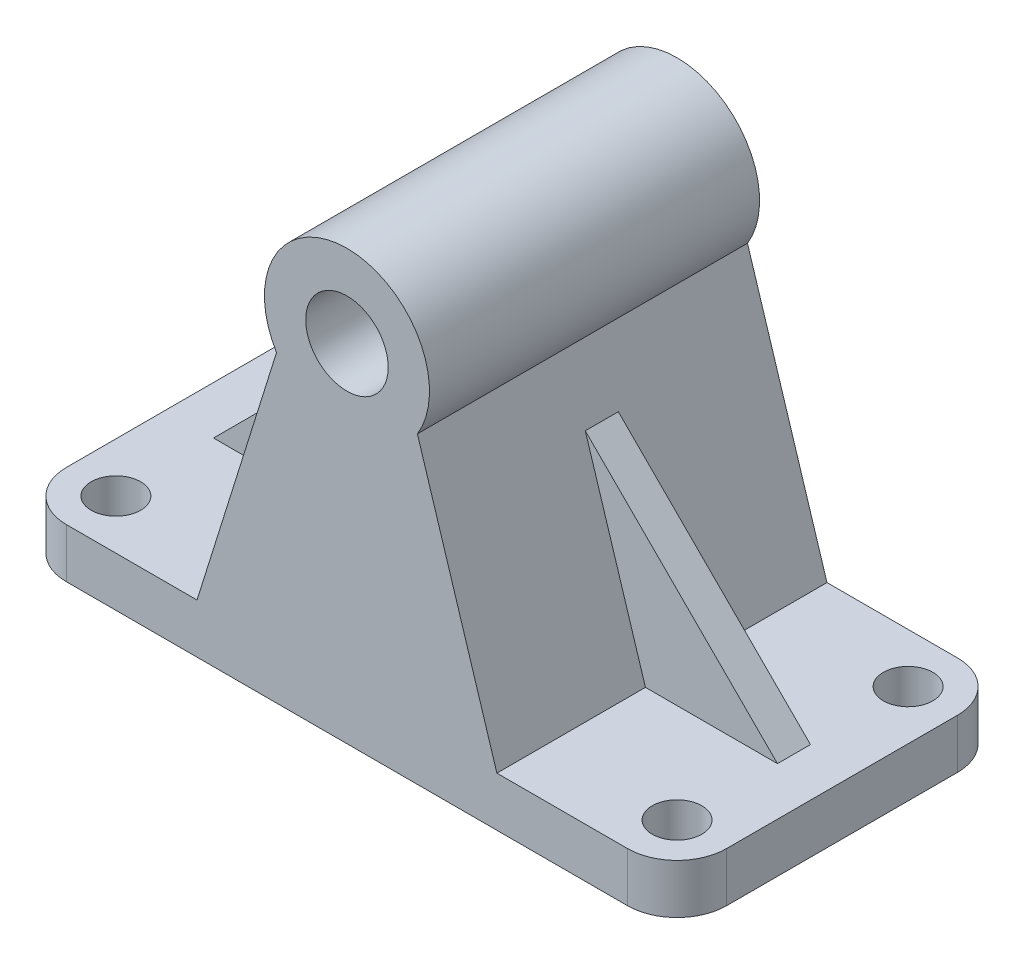
ISO-10303-21;
HEADER;
FILE_DESCRIPTION(('STEP AP214'),'2;1');
FILE_NAME('part.step','',(''),(''),'','','');
FILE_SCHEMA(('AUTOMOTIVE_DESIGN { 1 0 10303 214 1 1 1 1 }'));
ENDSEC;
DATA;
#1=APPLICATION_CONTEXT('core data for automotive mechanical design processes');
#2=APPLICATION_PROTOCOL_DEFINITION('international standard','automotive_design',2000,#1);
#3=PRODUCT_CONTEXT('',#1,'mechanical');
#4=PRODUCT('Part','Part','',(#3));
#5=PRODUCT_RELATED_PRODUCT_CATEGORY('part','',(#4));
#6=PRODUCT_DEFINITION_FORMATION('','',#4);
#7=PRODUCT_DEFINITION_CONTEXT('part definition',#1,'design');
#8=PRODUCT_DEFINITION('design','',#6,#7);
#9=PRODUCT_DEFINITION_SHAPE('','',#8);
#10=(LENGTH_UNIT() NAMED_UNIT(*) SI_UNIT(.MILLI.,.METRE.));
#11=(NAMED_UNIT(*) PLANE_ANGLE_UNIT() SI_UNIT($,.RADIAN.));
#12=(NAMED_UNIT(*) SI_UNIT($,.STERADIAN.) SOLID_ANGLE_UNIT());
#13=UNCERTAINTY_MEASURE_WITH_UNIT(LENGTH_MEASURE(1.E-05),#10,'distance_accuracy_value','');
#14=(GEOMETRIC_REPRESENTATION_CONTEXT(3) GLOBAL_UNCERTAINTY_ASSIGNED_CONTEXT((#13)) GLOBAL_UNIT_ASSIGNED_CONTEXT((#10,
#11,#12)) REPRESENTATION_CONTEXT('',''));
#15=CARTESIAN_POINT('',(0.,0.,0.));
#16=DIRECTION('',(0.,0.,1.));
#17=DIRECTION('',(1.,0.,0.));
#18=AXIS2_PLACEMENT_3D('',#15,#16,#17);
#19=CARTESIAN_POINT('',(-85.,15.,-35.));
#20=DIRECTION('',(0.,-1.,0.));
#21=DIRECTION('',(0.,0.,-1.));
#22=AXIS2_PLACEMENT_3D('',#19,#20,#21);
#23=PLANE('',#22);
#24=CARTESIAN_POINT('',(85.,15.,35.));
#25=DIRECTION('',(0.,1.,0.));
#26=DIRECTION('',(0.,0.,1.));
#27=AXIS2_PLACEMENT_3D('',#24,#25,#26);
#28=CIRCLE('',#27,7.50000000000001);
#29=CARTESIAN_POINT('',(85.,15.,42.5));
#30=VERTEX_POINT('',#29);
#31=EDGE_CURVE('E279',#30,#30,#28,.T.);
#32=ORIENTED_EDGE('',*,*,#31,.F.);
#33=EDGE_LOOP('',(#32));
#34=FACE_BOUND('',#33,.T.);
#35=CARTESIAN_POINT('',(85.,15.,-35.));
#36=DIRECTION('',(0.,1.,0.));
#37=DIRECTION('',(0.,0.,1.));
#38=AXIS2_PLACEMENT_3D('',#35,#36,#37);
#39=CIRCLE('',#38,7.50000000000001);
#40=CARTESIAN_POINT('',(85.,15.,-27.5));
#41=VERTEX_POINT('',#40);
#42=EDGE_CURVE('E265',#41,#41,#39,.T.);
#43=ORIENTED_EDGE('',*,*,#42,.F.);
#44=EDGE_LOOP('',(#43));
#45=FACE_BOUND('',#44,.T.);
#46=DIRECTION('',(1.,0.,0.));
#47=VECTOR('',#46,1.);
#48=CARTESIAN_POINT('',(85.4241553126404,15.,5.));
#49=LINE('',#48,#47);
#50=CARTESIAN_POINT('',(45.4241553126404,15.,5.));
#51=VERTEX_POINT('',#50);
#52=CARTESIAN_POINT('',(85.4241553126404,15.,5.));
#53=VERTEX_POINT('',#52);
#54=EDGE_CURVE('E178',#51,#53,#49,.T.);
#55=ORIENTED_EDGE('',*,*,#54,.F.);
#56=DIRECTION('',(0.,0.,-1.));
#57=VECTOR('',#56,1.);
#58=CARTESIAN_POINT('',(45.4241553126404,15.,50.));
#59=LINE('',#58,#57);
#60=CARTESIAN_POINT('',(45.4241553126404,15.,50.));
#61=VERTEX_POINT('',#60);
#62=EDGE_CURVE('E262',#61,#51,#59,.T.);
#63=ORIENTED_EDGE('',*,*,#62,.F.);
#64=DIRECTION('',(1.,0.,0.));
#65=VECTOR('',#64,1.);
#66=CARTESIAN_POINT('',(84.9999999999999,15.,50.));
#67=LINE('',#66,#65);
#68=CARTESIAN_POINT('',(84.9999999999999,15.,50.));
#69=VERTEX_POINT('',#68);
#70=EDGE_CURVE('E309',#61,#69,#67,.T.);
#71=ORIENTED_EDGE('',*,*,#70,.T.);
#72=CARTESIAN_POINT('',(85.,15.,35.));
#73=DIRECTION('',(0.,1.,0.));
#74=DIRECTION('',(0.,0.,-1.));
#75=AXIS2_PLACEMENT_3D('',#72,#73,#74);
#76=CIRCLE('',#75,15.);
#77=CARTESIAN_POINT('',(100.,15.,34.9999999999999));
#78=VERTEX_POINT('',#77);
#79=EDGE_CURVE('E314',#69,#78,#76,.T.);
#80=ORIENTED_EDGE('',*,*,#79,.T.);
#81=DIRECTION('',(0.,0.,-1.));
#82=VECTOR('',#81,1.);
#83=CARTESIAN_POINT('',(100.,15.,34.9999999999999));
#84=LINE('',#83,#82);
#85=CARTESIAN_POINT('',(100.,15.,-34.9999999999999));
#86=VERTEX_POINT('',#85);
#87=EDGE_CURVE('E317',#78,#86,#84,.T.);
#88=ORIENTED_EDGE('',*,*,#87,.T.);
#89=CARTESIAN_POINT('',(85.,15.,-35.));
#90=DIRECTION('',(0.,1.,0.));
#91=DIRECTION('',(0.,0.,1.));
#92=AXIS2_PLACEMENT_3D('',#89,#90,#91);
#93=CIRCLE('',#92,15.);
#94=CARTESIAN_POINT('',(84.9999999999999,15.,-50.));
#95=VERTEX_POINT('',#94);
#96=EDGE_CURVE('E320',#86,#95,#93,.T.);
#97=ORIENTED_EDGE('',*,*,#96,.T.);
#98=DIRECTION('',(-1.,0.,0.));
#99=VECTOR('',#98,1.);
#100=CARTESIAN_POINT('',(84.9999999999999,15.,-50.));
#101=LINE('',#100,#99);
#102=CARTESIAN_POINT('',(45.4241553126404,15.,-50.));
#103=VERTEX_POINT('',#102);
#104=EDGE_CURVE('E324',#95,#103,#101,.T.);
#105=ORIENTED_EDGE('',*,*,#104,.T.);
#106=CARTESIAN_POINT('',(45.4241553126404,15.,-5.));
#107=VERTEX_POINT('',#106);
#108=EDGE_CURVE('E261',#107,#103,#59,.T.);
#109=ORIENTED_EDGE('',*,*,#108,.F.);
#110=DIRECTION('',(1.,0.,0.));
#111=VECTOR('',#110,1.);
#112=CARTESIAN_POINT('',(85.4241553126404,15.,-5.));
#113=LINE('',#112,#111);
#114=CARTESIAN_POINT('',(85.4241553126404,15.,-5.));
#115=VERTEX_POINT('',#114);
#116=EDGE_CURVE('E55',#107,#115,#113,.T.);
#117=ORIENTED_EDGE('',*,*,#116,.T.);
#118=DIRECTION('',(0.,0.,-1.));
#119=VECTOR('',#118,1.);
#120=CARTESIAN_POINT('',(85.4241553126404,15.,5.));
#121=LINE('',#120,#119);
#122=EDGE_CURVE('E171',#53,#115,#121,.T.);
#123=ORIENTED_EDGE('',*,*,#122,.F.);
#124=EDGE_LOOP('',(#55,#63,#71,#80,#88,#97,#105,#109,#117,#123));
#125=FACE_BOUND('',#124,.T.);
#126=ADVANCED_FACE('F39',(#34,#45,#125),#23,.F.);
#127=CARTESIAN_POINT('',(45.4241553126404,15.,50.));
#128=DIRECTION('',(-0.954358113923542,-0.298664678842844,0.));
#129=DIRECTION('',(0.298664678842844,-0.954358113923542,0.));
#130=AXIS2_PLACEMENT_3D('',#127,#128,#129);
#131=PLANE('',#130);
#132=DIRECTION('',(0.298664678842844,-0.954358113923542,0.));
#133=VECTOR('',#132,1.);
#134=CARTESIAN_POINT('',(45.4241553126404,15.,5.));
#135=LINE('',#134,#133);
#136=CARTESIAN_POINT('',(27.204379858821,73.2197754538196,5.));
#137=VERTEX_POINT('',#136);
#138=EDGE_CURVE('E177',#137,#51,#135,.T.);
#139=ORIENTED_EDGE('',*,*,#138,.F.);
#140=DIRECTION('',(0.,0.,-1.));
#141=VECTOR('',#140,1.);
#142=CARTESIAN_POINT('',(27.204379858821,73.2197754538196,5.));
#143=LINE('',#142,#141);
#144=CARTESIAN_POINT('',(27.204379858821,73.2197754538196,-5.));
#145=VERTEX_POINT('',#144);
#146=EDGE_CURVE('E173',#137,#145,#143,.T.);
#147=ORIENTED_EDGE('',*,*,#146,.T.);
#148=DIRECTION('',(0.298664678842844,-0.954358113923542,0.));
#149=VECTOR('',#148,1.);
#150=CARTESIAN_POINT('',(45.4241553126404,15.,-5.));
#151=LINE('',#150,#149);
#152=EDGE_CURVE('E186',#145,#107,#151,.T.);
#153=ORIENTED_EDGE('',*,*,#152,.T.);
#154=ORIENTED_EDGE('',*,*,#108,.T.);
#155=DIRECTION('',(-0.298664678842844,0.954358113923542,0.));
#156=VECTOR('',#155,1.);
#157=CARTESIAN_POINT('',(45.4241553126404,15.,-50.));
#158=LINE('',#157,#156);
#159=CARTESIAN_POINT('',(21.3363046323666,91.9707212542346,-50.));
#160=VERTEX_POINT('',#159);
#161=EDGE_CURVE('E227',#103,#160,#158,.T.);
#162=ORIENTED_EDGE('',*,*,#161,.T.);
#163=DIRECTION('',(0.,0.,-1.));
#164=VECTOR('',#163,1.);
#165=CARTESIAN_POINT('',(21.3363046323666,91.9707212542346,50.));
#166=LINE('',#165,#164);
#167=CARTESIAN_POINT('',(21.3363046323666,91.9707212542346,50.));
#168=VERTEX_POINT('',#167);
#169=EDGE_CURVE('E257',#168,#160,#166,.T.);
#170=ORIENTED_EDGE('',*,*,#169,.F.);
#171=DIRECTION('',(-0.298664678842844,0.954358113923542,0.));
#172=VECTOR('',#171,1.);
#173=CARTESIAN_POINT('',(45.4241553126404,15.,50.));
#174=LINE('',#173,#172);
#175=EDGE_CURVE('E231',#61,#168,#174,.T.);
#176=ORIENTED_EDGE('',*,*,#175,.F.);
#177=ORIENTED_EDGE('',*,*,#62,.T.);
#178=EDGE_LOOP('',(#139,#147,#153,#154,#162,#170,#176,#177));
#179=FACE_BOUND('',#178,.T.);
#180=ADVANCED_FACE('F430',(#179),#131,.F.);
#181=CARTESIAN_POINT('',(-85.,15.,-35.));
#182=DIRECTION('',(0.,-1.,0.));
#183=DIRECTION('',(0.,0.,-1.));
#184=AXIS2_PLACEMENT_3D('',#181,#182,#183);
#185=CYLINDRICAL_SURFACE('',#184,15.);
#186=CARTESIAN_POINT('',(-85.,0.,-35.));
#187=DIRECTION('',(0.,1.,0.));
#188=DIRECTION('',(0.,0.,-1.));
#189=AXIS2_PLACEMENT_3D('',#186,#187,#188);
#190=CIRCLE('',#189,15.);
#191=CARTESIAN_POINT('',(-84.9999999999999,0.,-50.));
#192=VERTEX_POINT('',#191);
#193=CARTESIAN_POINT('',(-100.,0.,-34.9999999999999));
#194=VERTEX_POINT('',#193);
#195=EDGE_CURVE('E294',#192,#194,#190,.T.);
#196=ORIENTED_EDGE('',*,*,#195,.T.);
#197=DIRECTION('',(0.,-1.,0.));
#198=VECTOR('',#197,1.);
#199=CARTESIAN_POINT('',(-100.,15.,-34.9999999999999));
#200=LINE('',#199,#198);
#201=CARTESIAN_POINT('',(-100.,15.,-34.9999999999999));
#202=VERTEX_POINT('',#201);
#203=EDGE_CURVE('E11',#202,#194,#200,.T.);
#204=ORIENTED_EDGE('',*,*,#203,.F.);
#205=CARTESIAN_POINT('',(-85.,15.,-35.));
#206=DIRECTION('',(0.,1.,0.));
#207=DIRECTION('',(0.,0.,-1.));
#208=AXIS2_PLACEMENT_3D('',#205,#206,#207);
#209=CIRCLE('',#208,15.);
#210=CARTESIAN_POINT('',(-84.9999999999999,15.,-50.));
#211=VERTEX_POINT('',#210);
#212=EDGE_CURVE('E298',#211,#202,#209,.T.);
#213=ORIENTED_EDGE('',*,*,#212,.F.);
#214=DIRECTION('',(0.,-1.,0.));
#215=VECTOR('',#214,1.);
#216=CARTESIAN_POINT('',(-84.9999999999999,15.,-50.));
#217=LINE('',#216,#215);
#218=EDGE_CURVE('E328',#211,#192,#217,.T.);
#219=ORIENTED_EDGE('',*,*,#218,.T.);
#220=EDGE_LOOP('',(#196,#204,#213,#219));
#221=FACE_BOUND('',#220,.T.);
#222=ADVANCED_FACE('F41',(#221),#185,.T.);
#223=CARTESIAN_POINT('',(-100.,15.,34.9999999999999));
#224=DIRECTION('',(1.,0.,0.));
#225=DIRECTION('',(0.,0.,-1.));
#226=AXIS2_PLACEMENT_3D('',#223,#224,#225);
#227=PLANE('',#226);
#228=DIRECTION('',(0.,0.,1.));
#229=VECTOR('',#228,1.);
#230=CARTESIAN_POINT('',(-100.,0.,34.9999999999999));
#231=LINE('',#230,#229);
#232=CARTESIAN_POINT('',(-100.,0.,34.9999999999999));
#233=VERTEX_POINT('',#232);
#234=EDGE_CURVE('E332',#194,#233,#231,.T.);
#235=ORIENTED_EDGE('',*,*,#234,.T.);
#236=DIRECTION('',(0.,-1.,0.));
#237=VECTOR('',#236,1.);
#238=CARTESIAN_POINT('',(-100.,15.,34.9999999999999));
#239=LINE('',#238,#237);
#240=CARTESIAN_POINT('',(-100.,15.,34.9999999999999));
#241=VERTEX_POINT('',#240);
#242=EDGE_CURVE('E48',#241,#233,#239,.T.);
#243=ORIENTED_EDGE('',*,*,#242,.F.);
#244=DIRECTION('',(0.,0.,1.));
#245=VECTOR('',#244,1.);
#246=CARTESIAN_POINT('',(-100.,15.,34.9999999999999));
#247=LINE('',#246,#245);
#248=EDGE_CURVE('E302',#202,#241,#247,.T.);
#249=ORIENTED_EDGE('',*,*,#248,.F.);
#250=ORIENTED_EDGE('',*,*,#203,.T.);
#251=EDGE_LOOP('',(#235,#243,#249,#250));
#252=FACE_BOUND('',#251,.T.);
#253=ADVANCED_FACE('F421',(#252),#227,.F.);
#254=CARTESIAN_POINT('',(-85.,15.,35.));
#255=DIRECTION('',(0.,-1.,0.));
#256=DIRECTION('',(0.,0.,-1.));
#257=AXIS2_PLACEMENT_3D('',#254,#255,#256);
#258=CYLINDRICAL_SURFACE('',#257,15.);
#259=CARTESIAN_POINT('',(-85.,0.,35.));
#260=DIRECTION('',(0.,1.,0.));
#261=DIRECTION('',(0.,0.,-1.));
#262=AXIS2_PLACEMENT_3D('',#259,#260,#261);
#263=CIRCLE('',#262,15.);
#264=CARTESIAN_POINT('',(-84.9999999999999,0.,50.));
#265=VERTEX_POINT('',#264);
#266=EDGE_CURVE('E335',#233,#265,#263,.T.);
#267=ORIENTED_EDGE('',*,*,#266,.T.);
#268=DIRECTION('',(0.,-1.,0.));
#269=VECTOR('',#268,1.);
#270=CARTESIAN_POINT('',(-84.9999999999999,15.,50.));
#271=LINE('',#270,#269);
#272=CARTESIAN_POINT('',(-84.9999999999999,15.,50.));
#273=VERTEX_POINT('',#272);
#274=EDGE_CURVE('E371',#273,#265,#271,.T.);
#275=ORIENTED_EDGE('',*,*,#274,.F.);
#276=CARTESIAN_POINT('',(-85.,15.,35.));
#277=DIRECTION('',(0.,1.,0.));
#278=DIRECTION('',(0.,0.,-1.));
#279=AXIS2_PLACEMENT_3D('',#276,#277,#278);
#280=CIRCLE('',#279,15.);
#281=EDGE_CURVE('E306',#241,#273,#280,.T.);
#282=ORIENTED_EDGE('',*,*,#281,.F.);
#283=ORIENTED_EDGE('',*,*,#242,.T.);
#284=EDGE_LOOP('',(#267,#275,#282,#283));
#285=FACE_BOUND('',#284,.T.);
#286=ADVANCED_FACE('F380',(#285),#258,.T.);
#287=CARTESIAN_POINT('',(84.9999999999999,15.,50.));
#288=DIRECTION('',(0.,0.,-1.));
#289=DIRECTION('',(-1.,0.,0.));
#290=AXIS2_PLACEMENT_3D('',#287,#288,#289);
#291=PLANE('',#290);
#292=CARTESIAN_POINT('',(0.,105.,50.));
#293=DIRECTION('',(0.,0.,1.));
#294=DIRECTION('',(1.,0.,0.));
#295=AXIS2_PLACEMENT_3D('',#292,#293,#294);
#296=CIRCLE('',#295,12.5);
#297=CARTESIAN_POINT('',(12.5,105.,50.));
#298=VERTEX_POINT('',#297);
#299=EDGE_CURVE('E222',#298,#298,#296,.T.);
#300=ORIENTED_EDGE('',*,*,#299,.F.);
#301=EDGE_LOOP('',(#300));
#302=FACE_BOUND('',#301,.T.);
#303=DIRECTION('',(1.,0.,0.));
#304=VECTOR('',#303,1.);
#305=CARTESIAN_POINT('',(84.9999999999999,0.,50.));
#306=LINE('',#305,#304);
#307=CARTESIAN_POINT('',(84.9999999999999,0.,50.));
#308=VERTEX_POINT('',#307);
#309=EDGE_CURVE('E338',#265,#308,#306,.T.);
#310=ORIENTED_EDGE('',*,*,#309,.T.);
#311=DIRECTION('',(0.,-1.,0.));
#312=VECTOR('',#311,1.);
#313=CARTESIAN_POINT('',(84.9999999999999,15.,50.));
#314=LINE('',#313,#312);
#315=EDGE_CURVE('E367',#69,#308,#314,.T.);
#316=ORIENTED_EDGE('',*,*,#315,.F.);
#317=ORIENTED_EDGE('',*,*,#70,.F.);
#318=ORIENTED_EDGE('',*,*,#175,.T.);
#319=CARTESIAN_POINT('',(0.,105.,50.));
#320=DIRECTION('',(0.,0.,1.));
#321=DIRECTION('',(1.,0.,0.));
#322=AXIS2_PLACEMENT_3D('',#319,#320,#321);
#323=CIRCLE('',#322,25.);
#324=CARTESIAN_POINT('',(-21.3363046323666,91.9707212542346,50.));
#325=VERTEX_POINT('',#324);
#326=EDGE_CURVE('E234',#168,#325,#323,.T.);
#327=ORIENTED_EDGE('',*,*,#326,.T.);
#328=DIRECTION('',(-0.298664678842844,-0.954358113923542,0.));
#329=VECTOR('',#328,1.);
#330=CARTESIAN_POINT('',(-45.4241553126404,15.,50.));
#331=LINE('',#330,#329);
#332=CARTESIAN_POINT('',(-45.4241553126404,15.,50.));
#333=VERTEX_POINT('',#332);
#334=EDGE_CURVE('E238',#325,#333,#331,.T.);
#335=ORIENTED_EDGE('',*,*,#334,.T.);
#336=EDGE_CURVE('E310',#273,#333,#67,.T.);
#337=ORIENTED_EDGE('',*,*,#336,.F.);
#338=ORIENTED_EDGE('',*,*,#274,.T.);
#339=EDGE_LOOP('',(#310,#316,#317,#318,#327,#335,#337,#338));
#340=FACE_BOUND('',#339,.T.);
#341=ADVANCED_FACE('F391',(#302,#340),#291,.F.);
#342=CARTESIAN_POINT('',(85.,15.,35.));
#343=DIRECTION('',(0.,-1.,0.));
#344=DIRECTION('',(0.,0.,-1.));
#345=AXIS2_PLACEMENT_3D('',#342,#343,#344);
#346=CYLINDRICAL_SURFACE('',#345,15.);
#347=CARTESIAN_POINT('',(85.,0.,35.));
#348=DIRECTION('',(0.,1.,0.));
#349=DIRECTION('',(0.,0.,-1.));
#350=AXIS2_PLACEMENT_3D('',#347,#348,#349);
#351=CIRCLE('',#350,15.);
#352=CARTESIAN_POINT('',(100.,0.,34.9999999999999));
#353=VERTEX_POINT('',#352);
#354=EDGE_CURVE('E341',#308,#353,#351,.T.);
#355=ORIENTED_EDGE('',*,*,#354,.T.);
#356=DIRECTION('',(0.,-1.,0.));
#357=VECTOR('',#356,1.);
#358=CARTESIAN_POINT('',(100.,15.,34.9999999999999));
#359=LINE('',#358,#357);
#360=EDGE_CURVE('E363',#78,#353,#359,.T.);
#361=ORIENTED_EDGE('',*,*,#360,.F.);
#362=ORIENTED_EDGE('',*,*,#79,.F.);
#363=ORIENTED_EDGE('',*,*,#315,.T.);
#364=EDGE_LOOP('',(#355,#361,#362,#363));
#365=FACE_BOUND('',#364,.T.);
#366=ADVANCED_FACE('F396',(#365),#346,.T.);
#367=CARTESIAN_POINT('',(100.,15.,34.9999999999999));
#368=DIRECTION('',(-1.,0.,0.));
#369=DIRECTION('',(0.,0.,1.));
#370=AXIS2_PLACEMENT_3D('',#367,#368,#369);
#371=PLANE('',#370);
#372=DIRECTION('',(0.,0.,-1.));
#373=VECTOR('',#372,1.);
#374=CARTESIAN_POINT('',(100.,0.,34.9999999999999));
#375=LINE('',#374,#373);
#376=CARTESIAN_POINT('',(100.,0.,-34.9999999999999));
#377=VERTEX_POINT('',#376);
#378=EDGE_CURVE('E344',#353,#377,#375,.T.);
#379=ORIENTED_EDGE('',*,*,#378,.T.);
#380=DIRECTION('',(0.,-1.,0.));
#381=VECTOR('',#380,1.);
#382=CARTESIAN_POINT('',(100.,15.,-34.9999999999999));
#383=LINE('',#382,#381);
#384=EDGE_CURVE('E359',#86,#377,#383,.T.);
#385=ORIENTED_EDGE('',*,*,#384,.F.);
#386=ORIENTED_EDGE('',*,*,#87,.F.);
#387=ORIENTED_EDGE('',*,*,#360,.T.);
#388=EDGE_LOOP('',(#379,#385,#386,#387));
#389=FACE_BOUND('',#388,.T.);
#390=ADVANCED_FACE('F624',(#389),#371,.F.);
#391=CARTESIAN_POINT('',(85.,15.,-35.));
#392=DIRECTION('',(0.,-1.,0.));
#393=DIRECTION('',(0.,0.,-1.));
#394=AXIS2_PLACEMENT_3D('',#391,#392,#393);
#395=CYLINDRICAL_SURFACE('',#394,15.);
#396=CARTESIAN_POINT('',(85.,0.,-35.));
#397=DIRECTION('',(0.,1.,0.));
#398=DIRECTION('',(0.,0.,1.));
#399=AXIS2_PLACEMENT_3D('',#396,#397,#398);
#400=CIRCLE('',#399,15.);
#401=CARTESIAN_POINT('',(84.9999999999999,0.,-50.));
#402=VERTEX_POINT('',#401);
#403=EDGE_CURVE('E347',#377,#402,#400,.T.);
#404=ORIENTED_EDGE('',*,*,#403,.T.);
#405=DIRECTION('',(0.,-1.,0.));
#406=VECTOR('',#405,1.);
#407=CARTESIAN_POINT('',(84.9999999999999,15.,-50.));
#408=LINE('',#407,#406);
#409=EDGE_CURVE('E355',#95,#402,#408,.T.);
#410=ORIENTED_EDGE('',*,*,#409,.F.);
#411=ORIENTED_EDGE('',*,*,#96,.F.);
#412=ORIENTED_EDGE('',*,*,#384,.T.);
#413=EDGE_LOOP('',(#404,#410,#411,#412));
#414=FACE_BOUND('',#413,.T.);
#415=ADVANCED_FACE('F425',(#414),#395,.T.);
#416=CARTESIAN_POINT('',(84.9999999999999,15.,-50.));
#417=DIRECTION('',(0.,0.,1.));
#418=DIRECTION('',(1.,0.,0.));
#419=AXIS2_PLACEMENT_3D('',#416,#417,#418);
#420=PLANE('',#419);
#421=CARTESIAN_POINT('',(0.,105.,-50.));
#422=DIRECTION('',(0.,0.,1.));
#423=DIRECTION('',(1.,0.,0.));
#424=AXIS2_PLACEMENT_3D('',#421,#422,#423);
#425=CIRCLE('',#424,12.5);
#426=CARTESIAN_POINT('',(12.5,105.,-50.));
#427=VERTEX_POINT('',#426);
#428=EDGE_CURVE('E223',#427,#427,#425,.T.);
#429=ORIENTED_EDGE('',*,*,#428,.T.);
#430=EDGE_LOOP('',(#429));
#431=FACE_BOUND('',#430,.T.);
#432=DIRECTION('',(-1.,0.,0.));
#433=VECTOR('',#432,1.);
#434=CARTESIAN_POINT('',(84.9999999999999,0.,-50.));
#435=LINE('',#434,#433);
#436=EDGE_CURVE('E303',#402,#192,#435,.T.);
#437=ORIENTED_EDGE('',*,*,#436,.T.);
#438=ORIENTED_EDGE('',*,*,#218,.F.);
#439=CARTESIAN_POINT('',(-45.4241553126404,15.,-50.));
#440=VERTEX_POINT('',#439);
#441=EDGE_CURVE('E323',#440,#211,#101,.T.);
#442=ORIENTED_EDGE('',*,*,#441,.F.);
#443=DIRECTION('',(-0.298664678842844,-0.954358113923542,0.));
#444=VECTOR('',#443,1.);
#445=CARTESIAN_POINT('',(-45.4241553126404,15.,-50.));
#446=LINE('',#445,#444);
#447=CARTESIAN_POINT('',(-21.3363046323666,91.9707212542346,-50.));
#448=VERTEX_POINT('',#447);
#449=EDGE_CURVE('E235',#448,#440,#446,.T.);
#450=ORIENTED_EDGE('',*,*,#449,.F.);
#451=CARTESIAN_POINT('',(0.,105.,-50.));
#452=DIRECTION('',(0.,0.,1.));
#453=DIRECTION('',(1.,0.,0.));
#454=AXIS2_PLACEMENT_3D('',#451,#452,#453);
#455=CIRCLE('',#454,25.);
#456=EDGE_CURVE('E244',#160,#448,#455,.T.);
#457=ORIENTED_EDGE('',*,*,#456,.F.);
#458=ORIENTED_EDGE('',*,*,#161,.F.);
#459=ORIENTED_EDGE('',*,*,#104,.F.);
#460=ORIENTED_EDGE('',*,*,#409,.T.);
#461=EDGE_LOOP('',(#437,#438,#442,#450,#457,#458,#459,#460));
#462=FACE_BOUND('',#461,.T.);
#463=ADVANCED_FACE('F415',(#431,#462),#420,.F.);
#464=CARTESIAN_POINT('',(-85.,15.,35.));
#465=DIRECTION('',(0.,1.,0.));
#466=DIRECTION('',(0.,0.,1.));
#467=AXIS2_PLACEMENT_3D('',#464,#465,#466);
#468=CIRCLE('',#467,7.50000000000001);
#469=CARTESIAN_POINT('',(-85.,15.,42.5));
#470=VERTEX_POINT('',#469);
#471=EDGE_CURVE('E271',#470,#470,#468,.T.);
#472=ORIENTED_EDGE('',*,*,#471,.F.);
#473=EDGE_LOOP('',(#472));
#474=FACE_BOUND('',#473,.T.);
#475=CARTESIAN_POINT('',(-85.,15.,-35.));
#476=DIRECTION('',(0.,1.,0.));
#477=DIRECTION('',(0.,0.,1.));
#478=AXIS2_PLACEMENT_3D('',#475,#476,#477);
#479=CIRCLE('',#478,7.50000000000001);
#480=CARTESIAN_POINT('',(-85.,15.,-27.5));
#481=VERTEX_POINT('',#480);
#482=EDGE_CURVE('E270',#481,#481,#479,.T.);
#483=ORIENTED_EDGE('',*,*,#482,.F.);
#484=EDGE_LOOP('',(#483));
#485=FACE_BOUND('',#484,.T.);
#486=DIRECTION('',(0.,0.,-1.));
#487=VECTOR('',#486,1.);
#488=CARTESIAN_POINT('',(-45.4241553126404,15.,50.));
#489=LINE('',#488,#487);
#490=CARTESIAN_POINT('',(-45.4241553126404,15.,5.));
#491=VERTEX_POINT('',#490);
#492=EDGE_CURVE('E250',#333,#491,#489,.T.);
#493=ORIENTED_EDGE('',*,*,#492,.T.);
#494=DIRECTION('',(1.,0.,0.));
#495=VECTOR('',#494,1.);
#496=CARTESIAN_POINT('',(-85.4241553126404,15.,5.));
#497=LINE('',#496,#495);
#498=CARTESIAN_POINT('',(-85.4241553126404,15.,5.));
#499=VERTEX_POINT('',#498);
#500=EDGE_CURVE('E63',#499,#491,#497,.T.);
#501=ORIENTED_EDGE('',*,*,#500,.F.);
#502=DIRECTION('',(0.,0.,-1.));
#503=VECTOR('',#502,1.);
#504=CARTESIAN_POINT('',(-85.4241553126404,15.,5.));
#505=LINE('',#504,#503);
#506=CARTESIAN_POINT('',(-85.4241553126404,15.,-5.));
#507=VERTEX_POINT('',#506);
#508=EDGE_CURVE('E209',#499,#507,#505,.T.);
#509=ORIENTED_EDGE('',*,*,#508,.T.);
#510=DIRECTION('',(1.,0.,0.));
#511=VECTOR('',#510,1.);
#512=CARTESIAN_POINT('',(-85.4241553126404,15.,-5.));
#513=LINE('',#512,#511);
#514=CARTESIAN_POINT('',(-45.4241553126404,15.,-5.));
#515=VERTEX_POINT('',#514);
#516=EDGE_CURVE('E190',#507,#515,#513,.T.);
#517=ORIENTED_EDGE('',*,*,#516,.T.);
#518=EDGE_CURVE('E241',#515,#440,#489,.T.);
#519=ORIENTED_EDGE('',*,*,#518,.T.);
#520=ORIENTED_EDGE('',*,*,#441,.T.);
#521=ORIENTED_EDGE('',*,*,#212,.T.);
#522=ORIENTED_EDGE('',*,*,#248,.T.);
#523=ORIENTED_EDGE('',*,*,#281,.T.);
#524=ORIENTED_EDGE('',*,*,#336,.T.);
#525=EDGE_LOOP('',(#493,#501,#509,#517,#519,#520,#521,#522,#523,#524));
#526=FACE_BOUND('',#525,.T.);
#527=ADVANCED_FACE('F403',(#474,#485,#526),#23,.F.);
#528=CARTESIAN_POINT('',(-85.,0.,-35.));
#529=DIRECTION('',(0.,-1.,0.));
#530=DIRECTION('',(0.,0.,-1.));
#531=AXIS2_PLACEMENT_3D('',#528,#529,#530);
#532=PLANE('',#531);
#533=CARTESIAN_POINT('',(85.,0.,-35.));
#534=DIRECTION('',(0.,1.,0.));
#535=DIRECTION('',(0.,0.,1.));
#536=AXIS2_PLACEMENT_3D('',#533,#534,#535);
#537=CIRCLE('',#536,7.50000000000001);
#538=CARTESIAN_POINT('',(85.,0.,-27.5));
#539=VERTEX_POINT('',#538);
#540=EDGE_CURVE('E283',#539,#539,#537,.T.);
#541=ORIENTED_EDGE('',*,*,#540,.T.);
#542=EDGE_LOOP('',(#541));
#543=FACE_BOUND('',#542,.T.);
#544=CARTESIAN_POINT('',(85.,0.,35.));
#545=DIRECTION('',(0.,1.,0.));
#546=DIRECTION('',(0.,0.,1.));
#547=AXIS2_PLACEMENT_3D('',#544,#545,#546);
#548=CIRCLE('',#547,7.50000000000001);
#549=CARTESIAN_POINT('',(85.,0.,42.5));
#550=VERTEX_POINT('',#549);
#551=EDGE_CURVE('E275',#550,#550,#548,.T.);
#552=ORIENTED_EDGE('',*,*,#551,.T.);
#553=EDGE_LOOP('',(#552));
#554=FACE_BOUND('',#553,.T.);
#555=CARTESIAN_POINT('',(-85.,0.,35.));
#556=DIRECTION('',(0.,1.,0.));
#557=DIRECTION('',(0.,0.,1.));
#558=AXIS2_PLACEMENT_3D('',#555,#556,#557);
#559=CIRCLE('',#558,7.50000000000001);
#560=CARTESIAN_POINT('',(-85.,0.,42.5));
#561=VERTEX_POINT('',#560);
#562=EDGE_CURVE('E266',#561,#561,#559,.T.);
#563=ORIENTED_EDGE('',*,*,#562,.T.);
#564=EDGE_LOOP('',(#563));
#565=FACE_BOUND('',#564,.T.);
#566=CARTESIAN_POINT('',(-85.,0.,-35.));
#567=DIRECTION('',(0.,1.,0.));
#568=DIRECTION('',(0.,0.,1.));
#569=AXIS2_PLACEMENT_3D('',#566,#567,#568);
#570=CIRCLE('',#569,7.50000000000001);
#571=CARTESIAN_POINT('',(-85.,0.,-27.5));
#572=VERTEX_POINT('',#571);
#573=EDGE_CURVE('E290',#572,#572,#570,.T.);
#574=ORIENTED_EDGE('',*,*,#573,.T.);
#575=EDGE_LOOP('',(#574));
#576=FACE_BOUND('',#575,.T.);
#577=ORIENTED_EDGE('',*,*,#195,.F.);
#578=ORIENTED_EDGE('',*,*,#436,.F.);
#579=ORIENTED_EDGE('',*,*,#403,.F.);
#580=ORIENTED_EDGE('',*,*,#378,.F.);
#581=ORIENTED_EDGE('',*,*,#354,.F.);
#582=ORIENTED_EDGE('',*,*,#309,.F.);
#583=ORIENTED_EDGE('',*,*,#266,.F.);
#584=ORIENTED_EDGE('',*,*,#234,.F.);
#585=EDGE_LOOP('',(#577,#578,#579,#580,#581,#582,#583,#584));
#586=FACE_BOUND('',#585,.T.);
#587=ADVANCED_FACE('F386',(#543,#554,#565,#576,#586),#532,.T.);
#588=CARTESIAN_POINT('',(-85.,0.,-35.));
#589=DIRECTION('',(0.,1.,0.));
#590=DIRECTION('',(0.,0.,1.));
#591=AXIS2_PLACEMENT_3D('',#588,#589,#590);
#592=CYLINDRICAL_SURFACE('',#591,7.50000000000001);
#593=ORIENTED_EDGE('',*,*,#573,.F.);
#594=EDGE_LOOP('',(#593));
#595=FACE_BOUND('',#594,.T.);
#596=ORIENTED_EDGE('',*,*,#482,.T.);
#597=EDGE_LOOP('',(#596));
#598=FACE_BOUND('',#597,.T.);
#599=ADVANCED_FACE('F465',(#595,#598),#592,.F.);
#600=CARTESIAN_POINT('',(-85.,0.,35.));
#601=DIRECTION('',(0.,1.,0.));
#602=DIRECTION('',(0.,0.,1.));
#603=AXIS2_PLACEMENT_3D('',#600,#601,#602);
#604=CYLINDRICAL_SURFACE('',#603,7.50000000000001);
#605=ORIENTED_EDGE('',*,*,#562,.F.);
#606=EDGE_LOOP('',(#605));
#607=FACE_BOUND('',#606,.T.);
#608=ORIENTED_EDGE('',*,*,#471,.T.);
#609=EDGE_LOOP('',(#608));
#610=FACE_BOUND('',#609,.T.);
#611=ADVANCED_FACE('F474',(#607,#610),#604,.F.);
#612=CARTESIAN_POINT('',(85.,0.,35.));
#613=DIRECTION('',(0.,1.,0.));
#614=DIRECTION('',(0.,0.,1.));
#615=AXIS2_PLACEMENT_3D('',#612,#613,#614);
#616=CYLINDRICAL_SURFACE('',#615,7.50000000000001);
#617=ORIENTED_EDGE('',*,*,#551,.F.);
#618=EDGE_LOOP('',(#617));
#619=FACE_BOUND('',#618,.T.);
#620=ORIENTED_EDGE('',*,*,#31,.T.);
#621=EDGE_LOOP('',(#620));
#622=FACE_BOUND('',#621,.T.);
#623=ADVANCED_FACE('F479',(#619,#622),#616,.F.);
#624=CARTESIAN_POINT('',(85.,0.,-35.));
#625=DIRECTION('',(0.,1.,0.));
#626=DIRECTION('',(0.,0.,1.));
#627=AXIS2_PLACEMENT_3D('',#624,#625,#626);
#628=CYLINDRICAL_SURFACE('',#627,7.50000000000001);
#629=ORIENTED_EDGE('',*,*,#540,.F.);
#630=EDGE_LOOP('',(#629));
#631=FACE_BOUND('',#630,.T.);
#632=ORIENTED_EDGE('',*,*,#42,.T.);
#633=EDGE_LOOP('',(#632));
#634=FACE_BOUND('',#633,.T.);
#635=ADVANCED_FACE('F484',(#631,#634),#628,.F.);
#636=CARTESIAN_POINT('',(0.,105.,50.));
#637=DIRECTION('',(0.,0.,-1.));
#638=DIRECTION('',(-1.,0.,0.));
#639=AXIS2_PLACEMENT_3D('',#636,#637,#638);
#640=CYLINDRICAL_SURFACE('',#639,25.);
#641=ORIENTED_EDGE('',*,*,#456,.T.);
#642=DIRECTION('',(0.,0.,-1.));
#643=VECTOR('',#642,1.);
#644=CARTESIAN_POINT('',(-21.3363046323666,91.9707212542346,50.));
#645=LINE('',#644,#643);
#646=EDGE_CURVE('E253',#325,#448,#645,.T.);
#647=ORIENTED_EDGE('',*,*,#646,.F.);
#648=ORIENTED_EDGE('',*,*,#326,.F.);
#649=ORIENTED_EDGE('',*,*,#169,.T.);
#650=EDGE_LOOP('',(#641,#647,#648,#649));
#651=FACE_BOUND('',#650,.T.);
#652=ADVANCED_FACE('F487',(#651),#640,.T.);
#653=CARTESIAN_POINT('',(-45.4241553126404,15.,50.));
#654=DIRECTION('',(0.954358113923542,-0.298664678842844,0.));
#655=DIRECTION('',(0.298664678842844,0.954358113923542,0.));
#656=AXIS2_PLACEMENT_3D('',#653,#654,#655);
#657=PLANE('',#656);
#658=DIRECTION('',(0.,0.,-1.));
#659=VECTOR('',#658,1.);
#660=CARTESIAN_POINT('',(-27.204379858821,73.2197754538196,5.));
#661=LINE('',#660,#659);
#662=CARTESIAN_POINT('',(-27.204379858821,73.2197754538196,5.));
#663=VERTEX_POINT('',#662);
#664=CARTESIAN_POINT('',(-27.204379858821,73.2197754538196,-5.));
#665=VERTEX_POINT('',#664);
#666=EDGE_CURVE('E218',#663,#665,#661,.T.);
#667=ORIENTED_EDGE('',*,*,#666,.F.);
#668=DIRECTION('',(0.298664678842844,0.954358113923542,0.));
#669=VECTOR('',#668,1.);
#670=CARTESIAN_POINT('',(-45.4241553126404,15.,5.));
#671=LINE('',#670,#669);
#672=EDGE_CURVE('E202',#491,#663,#671,.T.);
#673=ORIENTED_EDGE('',*,*,#672,.F.);
#674=ORIENTED_EDGE('',*,*,#492,.F.);
#675=ORIENTED_EDGE('',*,*,#334,.F.);
#676=ORIENTED_EDGE('',*,*,#646,.T.);
#677=ORIENTED_EDGE('',*,*,#449,.T.);
#678=ORIENTED_EDGE('',*,*,#518,.F.);
#679=DIRECTION('',(0.298664678842844,0.954358113923542,0.));
#680=VECTOR('',#679,1.);
#681=CARTESIAN_POINT('',(-45.4241553126404,15.,-5.));
#682=LINE('',#681,#680);
#683=EDGE_CURVE('E195',#515,#665,#682,.T.);
#684=ORIENTED_EDGE('',*,*,#683,.T.);
#685=EDGE_LOOP('',(#667,#673,#674,#675,#676,#677,#678,#684));
#686=FACE_BOUND('',#685,.T.);
#687=ADVANCED_FACE('F410',(#686),#657,.F.);
#688=CARTESIAN_POINT('',(0.,105.,-50.));
#689=DIRECTION('',(0.,0.,1.));
#690=DIRECTION('',(1.,0.,0.));
#691=AXIS2_PLACEMENT_3D('',#688,#689,#690);
#692=CYLINDRICAL_SURFACE('',#691,12.5);
#693=ORIENTED_EDGE('',*,*,#428,.F.);
#694=EDGE_LOOP('',(#693));
#695=FACE_BOUND('',#694,.T.);
#696=ORIENTED_EDGE('',*,*,#299,.T.);
#697=EDGE_LOOP('',(#696));
#698=FACE_BOUND('',#697,.T.);
#699=ADVANCED_FACE('F497',(#695,#698),#692,.F.);
#700=CARTESIAN_POINT('',(-85.4241553126404,15.,5.));
#701=DIRECTION('',(0.707106781186549,-0.707106781186546,0.));
#702=DIRECTION('',(0.707106781186546,0.707106781186549,0.));
#703=AXIS2_PLACEMENT_3D('',#700,#701,#702);
#704=PLANE('',#703);
#705=DIRECTION('',(-0.707106781186546,-0.707106781186549,0.));
#706=VECTOR('',#705,1.);
#707=CARTESIAN_POINT('',(-85.4241553126404,15.,-5.));
#708=LINE('',#707,#706);
#709=EDGE_CURVE('E203',#665,#507,#708,.T.);
#710=ORIENTED_EDGE('',*,*,#709,.T.);
#711=ORIENTED_EDGE('',*,*,#508,.F.);
#712=DIRECTION('',(-0.707106781186546,-0.707106781186549,0.));
#713=VECTOR('',#712,1.);
#714=CARTESIAN_POINT('',(-85.4241553126404,15.,5.));
#715=LINE('',#714,#713);
#716=EDGE_CURVE('E207',#663,#499,#715,.T.);
#717=ORIENTED_EDGE('',*,*,#716,.F.);
#718=ORIENTED_EDGE('',*,*,#666,.T.);
#719=EDGE_LOOP('',(#710,#711,#717,#718));
#720=FACE_BOUND('',#719,.T.);
#721=ADVANCED_FACE('F500',(#720),#704,.F.);
#722=CARTESIAN_POINT('',(0.,0.,5.));
#723=DIRECTION('',(0.,0.,1.));
#724=DIRECTION('',(1.,0.,0.));
#725=AXIS2_PLACEMENT_3D('',#722,#723,#724);
#726=PLANE('',#725);
#727=ORIENTED_EDGE('',*,*,#500,.T.);
#728=ORIENTED_EDGE('',*,*,#672,.T.);
#729=ORIENTED_EDGE('',*,*,#716,.T.);
#730=EDGE_LOOP('',(#727,#728,#729));
#731=FACE_BOUND('',#730,.T.);
#732=ADVANCED_FACE('F504',(#731),#726,.T.);
#733=CARTESIAN_POINT('',(0.,0.,-5.));
#734=DIRECTION('',(0.,0.,1.));
#735=DIRECTION('',(1.,0.,0.));
#736=AXIS2_PLACEMENT_3D('',#733,#734,#735);
#737=PLANE('',#736);
#738=ORIENTED_EDGE('',*,*,#516,.F.);
#739=ORIENTED_EDGE('',*,*,#709,.F.);
#740=ORIENTED_EDGE('',*,*,#683,.F.);
#741=EDGE_LOOP('',(#738,#739,#740));
#742=FACE_BOUND('',#741,.T.);
#743=ADVANCED_FACE('F506',(#742),#737,.F.);
#744=CARTESIAN_POINT('',(85.4241553126404,15.,5.));
#745=DIRECTION('',(-0.707106781186549,-0.707106781186546,0.));
#746=DIRECTION('',(0.707106781186546,-0.707106781186549,0.));
#747=AXIS2_PLACEMENT_3D('',#744,#745,#746);
#748=PLANE('',#747);
#749=DIRECTION('',(-0.707106781186546,0.707106781186549,0.));
#750=VECTOR('',#749,1.);
#751=CARTESIAN_POINT('',(85.4241553126404,15.,-5.));
#752=LINE('',#751,#750);
#753=EDGE_CURVE('E433',#115,#145,#752,.T.);
#754=ORIENTED_EDGE('',*,*,#753,.T.);
#755=ORIENTED_EDGE('',*,*,#146,.F.);
#756=DIRECTION('',(-0.707106781186546,0.707106781186549,0.));
#757=VECTOR('',#756,1.);
#758=CARTESIAN_POINT('',(85.4241553126404,15.,5.));
#759=LINE('',#758,#757);
#760=EDGE_CURVE('E167',#53,#137,#759,.T.);
#761=ORIENTED_EDGE('',*,*,#760,.F.);
#762=ORIENTED_EDGE('',*,*,#122,.T.);
#763=EDGE_LOOP('',(#754,#755,#761,#762));
#764=FACE_BOUND('',#763,.T.);
#765=ADVANCED_FACE('F169',(#764),#748,.F.);
#766=CARTESIAN_POINT('',(0.,0.,5.));
#767=DIRECTION('',(0.,0.,-1.));
#768=DIRECTION('',(-1.,0.,0.));
#769=AXIS2_PLACEMENT_3D('',#766,#767,#768);
#770=PLANE('',#769);
#771=ORIENTED_EDGE('',*,*,#54,.T.);
#772=ORIENTED_EDGE('',*,*,#760,.T.);
#773=ORIENTED_EDGE('',*,*,#138,.T.);
#774=EDGE_LOOP('',(#771,#772,#773));
#775=FACE_BOUND('',#774,.T.);
#776=ADVANCED_FACE('F181',(#775),#770,.F.);
#777=CARTESIAN_POINT('',(0.,0.,-5.));
#778=DIRECTION('',(0.,0.,-1.));
#779=DIRECTION('',(-1.,0.,0.));
#780=AXIS2_PLACEMENT_3D('',#777,#778,#779);
#781=PLANE('',#780);
#782=ORIENTED_EDGE('',*,*,#116,.F.);
#783=ORIENTED_EDGE('',*,*,#152,.F.);
#784=ORIENTED_EDGE('',*,*,#753,.F.);
#785=EDGE_LOOP('',(#782,#783,#784));
#786=FACE_BOUND('',#785,.T.);
#787=ADVANCED_FACE('F440',(#786),#781,.T.);
#788=CLOSED_SHELL('',(#126,#180,#222,#253,#286,#341,#366,#390,#415,#463,#527,#587,#599,#611,
#623,#635,#652,#687,#699,#721,#732,#743,#765,#776,#787));
#789=MANIFOLD_SOLID_BREP('B2',#788);
#790=ADVANCED_BREP_SHAPE_REPRESENTATION('',(#18,#789),#14);
#791=SHAPE_DEFINITION_REPRESENTATION(#9,#790);
ENDSEC;
END-ISO-10303-21;
